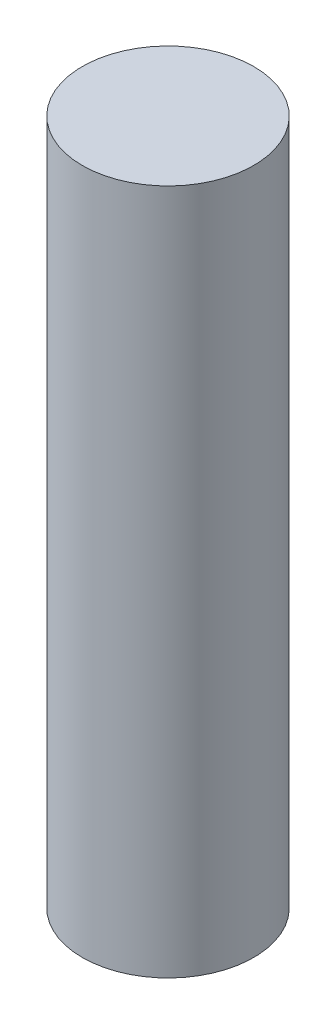
ISO-10303-21;
HEADER;
FILE_DESCRIPTION(('STEP AP214'),'2;1');
FILE_NAME('part.step','',(''),(''),'','','');
FILE_SCHEMA(('AUTOMOTIVE_DESIGN { 1 0 10303 214 1 1 1 1 }'));
ENDSEC;
DATA;
#1=APPLICATION_CONTEXT('core data for automotive mechanical design processes');
#2=APPLICATION_PROTOCOL_DEFINITION('international standard','automotive_design',2000,#1);
#3=PRODUCT_CONTEXT('',#1,'mechanical');
#4=PRODUCT('Part','Part','',(#3));
#5=PRODUCT_RELATED_PRODUCT_CATEGORY('part','',(#4));
#6=PRODUCT_DEFINITION_FORMATION('','',#4);
#7=PRODUCT_DEFINITION_CONTEXT('part definition',#1,'design');
#8=PRODUCT_DEFINITION('design','',#6,#7);
#9=PRODUCT_DEFINITION_SHAPE('','',#8);
#10=(LENGTH_UNIT() NAMED_UNIT(*) SI_UNIT(.MILLI.,.METRE.));
#11=(NAMED_UNIT(*) PLANE_ANGLE_UNIT() SI_UNIT($,.RADIAN.));
#12=(NAMED_UNIT(*) SI_UNIT($,.STERADIAN.) SOLID_ANGLE_UNIT());
#13=UNCERTAINTY_MEASURE_WITH_UNIT(LENGTH_MEASURE(1.E-05),#10,'distance_accuracy_value','');
#14=(GEOMETRIC_REPRESENTATION_CONTEXT(3) GLOBAL_UNCERTAINTY_ASSIGNED_CONTEXT((#13)) GLOBAL_UNIT_ASSIGNED_CONTEXT((#10,
#11,#12)) REPRESENTATION_CONTEXT('',''));
#15=CARTESIAN_POINT('',(0.,0.,0.));
#16=DIRECTION('',(0.,0.,1.));
#17=DIRECTION('',(1.,0.,0.));
#18=AXIS2_PLACEMENT_3D('',#15,#16,#17);
#19=CARTESIAN_POINT('',(0.,80.,0.));
#20=DIRECTION('',(0.,-1.,0.));
#21=DIRECTION('',(0.,0.,-1.));
#22=AXIS2_PLACEMENT_3D('',#19,#20,#21);
#23=CYLINDRICAL_SURFACE('',#22,9.99999999999999);
#24=CARTESIAN_POINT('',(0.,80.,0.));
#25=DIRECTION('',(0.,1.,0.));
#26=DIRECTION('',(0.,0.,1.));
#27=AXIS2_PLACEMENT_3D('',#24,#25,#26);
#28=CIRCLE('',#27,9.99999999999999);
#29=CARTESIAN_POINT('',(0.,80.,9.99999999999999));
#30=VERTEX_POINT('',#29);
#31=EDGE_CURVE('E10',#30,#30,#28,.T.);
#32=ORIENTED_EDGE('',*,*,#31,.F.);
#33=EDGE_LOOP('',(#32));
#34=FACE_BOUND('',#33,.T.);
#35=CARTESIAN_POINT('',(0.,0.,0.));
#36=DIRECTION('',(0.,1.,0.));
#37=DIRECTION('',(0.,0.,1.));
#38=AXIS2_PLACEMENT_3D('',#35,#36,#37);
#39=CIRCLE('',#38,9.99999999999999);
#40=CARTESIAN_POINT('',(0.,0.,9.99999999999999));
#41=VERTEX_POINT('',#40);
#42=EDGE_CURVE('E46',#41,#41,#39,.T.);
#43=ORIENTED_EDGE('',*,*,#42,.T.);
#44=EDGE_LOOP('',(#43));
#45=FACE_BOUND('',#44,.T.);
#46=ADVANCED_FACE('F43',(#34,#45),#23,.T.);
#47=CARTESIAN_POINT('',(0.,80.,0.));
#48=DIRECTION('',(0.,1.,0.));
#49=DIRECTION('',(0.,0.,1.));
#50=AXIS2_PLACEMENT_3D('',#47,#48,#49);
#51=PLANE('',#50);
#52=ORIENTED_EDGE('',*,*,#31,.T.);
#53=EDGE_LOOP('',(#52));
#54=FACE_BOUND('',#53,.T.);
#55=ADVANCED_FACE('F60',(#54),#51,.T.);
#56=CARTESIAN_POINT('',(0.,0.,0.));
#57=DIRECTION('',(0.,1.,0.));
#58=DIRECTION('',(0.,0.,1.));
#59=AXIS2_PLACEMENT_3D('',#56,#57,#58);
#60=PLANE('',#59);
#61=ORIENTED_EDGE('',*,*,#42,.F.);
#62=EDGE_LOOP('',(#61));
#63=FACE_BOUND('',#62,.T.);
#64=ADVANCED_FACE('F58',(#63),#60,.F.);
#65=CLOSED_SHELL('',(#46,#55,#64));
#66=MANIFOLD_SOLID_BREP('B2',#65);
#67=ADVANCED_BREP_SHAPE_REPRESENTATION('',(#18,#66),#14);
#68=SHAPE_DEFINITION_REPRESENTATION(#9,#67);
ENDSEC;
END-ISO-10303-21;
